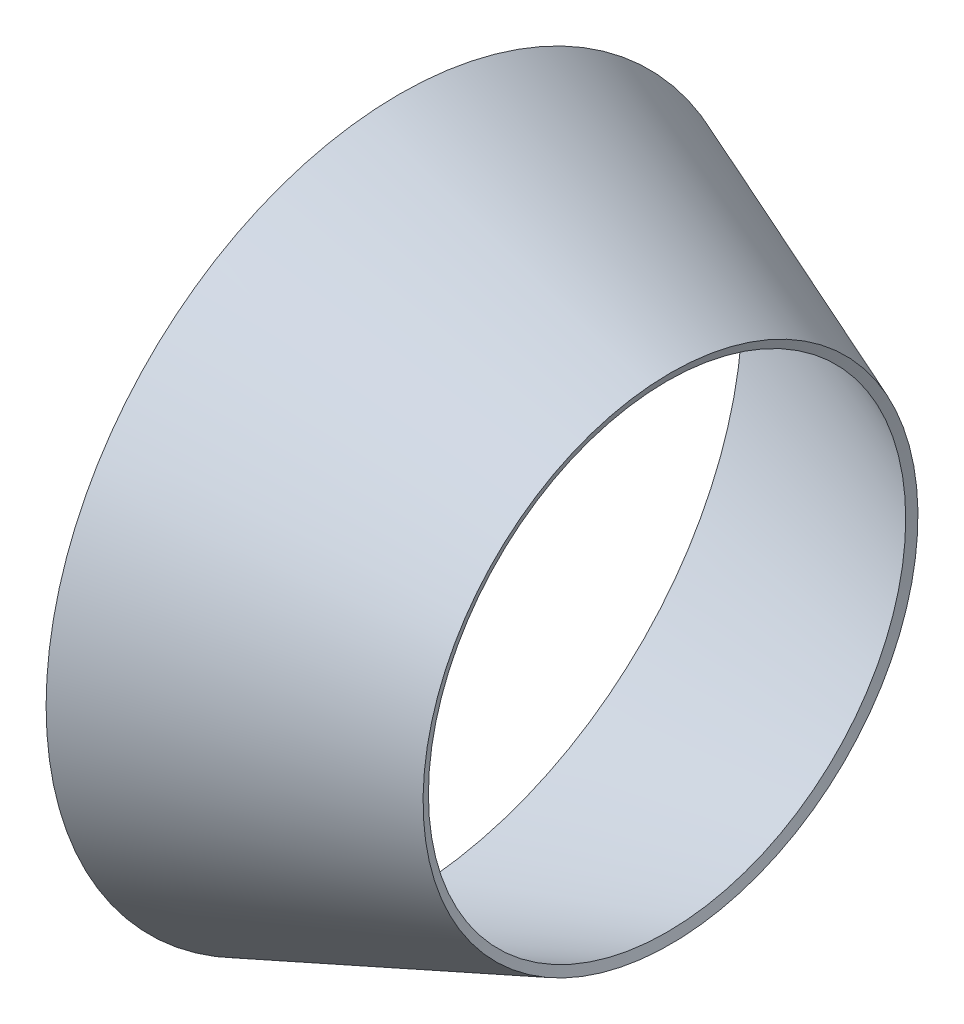
ISO-10303-21;
HEADER;
FILE_DESCRIPTION(('STEP AP214'),'2;1');
FILE_NAME('part.step','',(''),(''),'','','');
FILE_SCHEMA(('AUTOMOTIVE_DESIGN { 1 0 10303 214 1 1 1 1 }'));
ENDSEC;
DATA;
#1=APPLICATION_CONTEXT('core data for automotive mechanical design processes');
#2=APPLICATION_PROTOCOL_DEFINITION('international standard','automotive_design',2000,#1);
#3=PRODUCT_CONTEXT('',#1,'mechanical');
#4=PRODUCT('Part','Part','',(#3));
#5=PRODUCT_RELATED_PRODUCT_CATEGORY('part','',(#4));
#6=PRODUCT_DEFINITION_FORMATION('','',#4);
#7=PRODUCT_DEFINITION_CONTEXT('part definition',#1,'design');
#8=PRODUCT_DEFINITION('design','',#6,#7);
#9=PRODUCT_DEFINITION_SHAPE('','',#8);
#10=(LENGTH_UNIT() NAMED_UNIT(*) SI_UNIT(.MILLI.,.METRE.));
#11=(NAMED_UNIT(*) PLANE_ANGLE_UNIT() SI_UNIT($,.RADIAN.));
#12=(NAMED_UNIT(*) SI_UNIT($,.STERADIAN.) SOLID_ANGLE_UNIT());
#13=UNCERTAINTY_MEASURE_WITH_UNIT(LENGTH_MEASURE(1.E-05),#10,'distance_accuracy_value','');
#14=(GEOMETRIC_REPRESENTATION_CONTEXT(3) GLOBAL_UNCERTAINTY_ASSIGNED_CONTEXT((#13)) GLOBAL_UNIT_ASSIGNED_CONTEXT((#10,
#11,#12)) REPRESENTATION_CONTEXT('',''));
#15=CARTESIAN_POINT('',(0.,0.,0.));
#16=DIRECTION('',(0.,0.,1.));
#17=DIRECTION('',(1.,0.,0.));
#18=AXIS2_PLACEMENT_3D('',#15,#16,#17);
#19=CARTESIAN_POINT('',(-42.0913034547145,-47.5160512242137,0.));
#20=DIRECTION('',(1.,0.,0.));
#21=DIRECTION('',(0.,1.,0.));
#22=AXIS2_PLACEMENT_3D('',#19,#20,#21);
#23=PLANE('',#22);
#24=CARTESIAN_POINT('',(-42.0913034547145,0.,0.));
#25=DIRECTION('',(1.,0.,0.));
#26=DIRECTION('',(0.,1.,0.));
#27=AXIS2_PLACEMENT_3D('',#24,#25,#26);
#28=CIRCLE('',#27,47.5160512242137);
#29=CARTESIAN_POINT('',(-42.0913034547145,47.5160512242137,0.));
#30=VERTEX_POINT('',#29);
#31=EDGE_CURVE('E10',#30,#30,#28,.T.);
#32=ORIENTED_EDGE('',*,*,#31,.F.);
#33=EDGE_LOOP('',(#32));
#34=FACE_BOUND('',#33,.T.);
#35=CARTESIAN_POINT('',(-42.0913034547145,0.,0.));
#36=DIRECTION('',(1.,0.,0.));
#37=DIRECTION('',(0.,1.,0.));
#38=AXIS2_PLACEMENT_3D('',#35,#36,#37);
#39=CIRCLE('',#38,46.1527145178048);
#40=CARTESIAN_POINT('',(-42.0913034547145,46.1527145178048,0.));
#41=VERTEX_POINT('',#40);
#42=EDGE_CURVE('E49',#41,#41,#39,.T.);
#43=ORIENTED_EDGE('',*,*,#42,.T.);
#44=EDGE_LOOP('',(#43));
#45=FACE_BOUND('',#44,.T.);
#46=ADVANCED_FACE('F35',(#34,#45),#23,.F.);
#47=CARTESIAN_POINT('',(-42.0913034547145,0.,0.));
#48=DIRECTION('',(-1.,0.,0.));
#49=DIRECTION('',(0.,-1.,0.));
#50=AXIS2_PLACEMENT_3D('',#47,#48,#49);
#51=CONICAL_SURFACE('',#50,47.5160512242137,0.372176622120099);
#52=CARTESIAN_POINT('',(-5.6259548278134,0.,0.));
#53=DIRECTION('',(1.,0.,0.));
#54=DIRECTION('',(0.,1.,0.));
#55=AXIS2_PLACEMENT_3D('',#52,#53,#54);
#56=CIRCLE('',#55,33.2810967886729);
#57=CARTESIAN_POINT('',(-5.6259548278134,33.2810967886729,0.));
#58=VERTEX_POINT('',#57);
#59=EDGE_CURVE('E41',#58,#58,#56,.T.);
#60=ORIENTED_EDGE('',*,*,#59,.F.);
#61=EDGE_LOOP('',(#60));
#62=FACE_BOUND('',#61,.T.);
#63=ORIENTED_EDGE('',*,*,#31,.T.);
#64=EDGE_LOOP('',(#63));
#65=FACE_BOUND('',#64,.T.);
#66=ADVANCED_FACE('F64',(#62,#65),#51,.T.);
#67=CARTESIAN_POINT('',(-5.6259548278134,0.,0.));
#68=DIRECTION('',(1.,0.,0.));
#69=DIRECTION('',(0.,1.,0.));
#70=AXIS2_PLACEMENT_3D('',#67,#68,#69);
#71=CONICAL_SURFACE('',#70,33.2810967886729,1.1986197046748);
#72=CARTESIAN_POINT('',(-6.08778257837086,0.,0.));
#73=DIRECTION('',(1.,0.,0.));
#74=DIRECTION('',(0.,1.,0.));
#75=AXIS2_PLACEMENT_3D('',#72,#73,#74);
#76=CIRCLE('',#75,32.0980434809919);
#77=CARTESIAN_POINT('',(-6.08778257837086,32.0980434809919,0.));
#78=VERTEX_POINT('',#77);
#79=EDGE_CURVE('E45',#78,#78,#76,.T.);
#80=ORIENTED_EDGE('',*,*,#79,.F.);
#81=EDGE_LOOP('',(#80));
#82=FACE_BOUND('',#81,.T.);
#83=ORIENTED_EDGE('',*,*,#59,.T.);
#84=EDGE_LOOP('',(#83));
#85=FACE_BOUND('',#84,.T.);
#86=ADVANCED_FACE('F59',(#82,#85),#71,.F.);
#87=CARTESIAN_POINT('',(-6.08778257837086,0.,0.));
#88=DIRECTION('',(-1.,0.,0.));
#89=DIRECTION('',(0.,-1.,0.));
#90=AXIS2_PLACEMENT_3D('',#87,#88,#89);
#91=CONICAL_SURFACE('',#90,32.0980434809919,0.3721766221201);
#92=ORIENTED_EDGE('',*,*,#42,.F.);
#93=EDGE_LOOP('',(#92));
#94=FACE_BOUND('',#93,.T.);
#95=ORIENTED_EDGE('',*,*,#79,.T.);
#96=EDGE_LOOP('',(#95));
#97=FACE_BOUND('',#96,.T.);
#98=ADVANCED_FACE('F56',(#94,#97),#91,.F.);
#99=CLOSED_SHELL('',(#46,#66,#86,#98));
#100=MANIFOLD_SOLID_BREP('B2',#99);
#101=ADVANCED_BREP_SHAPE_REPRESENTATION('',(#18,#100),#14);
#102=SHAPE_DEFINITION_REPRESENTATION(#9,#101);
ENDSEC;
END-ISO-10303-21;
